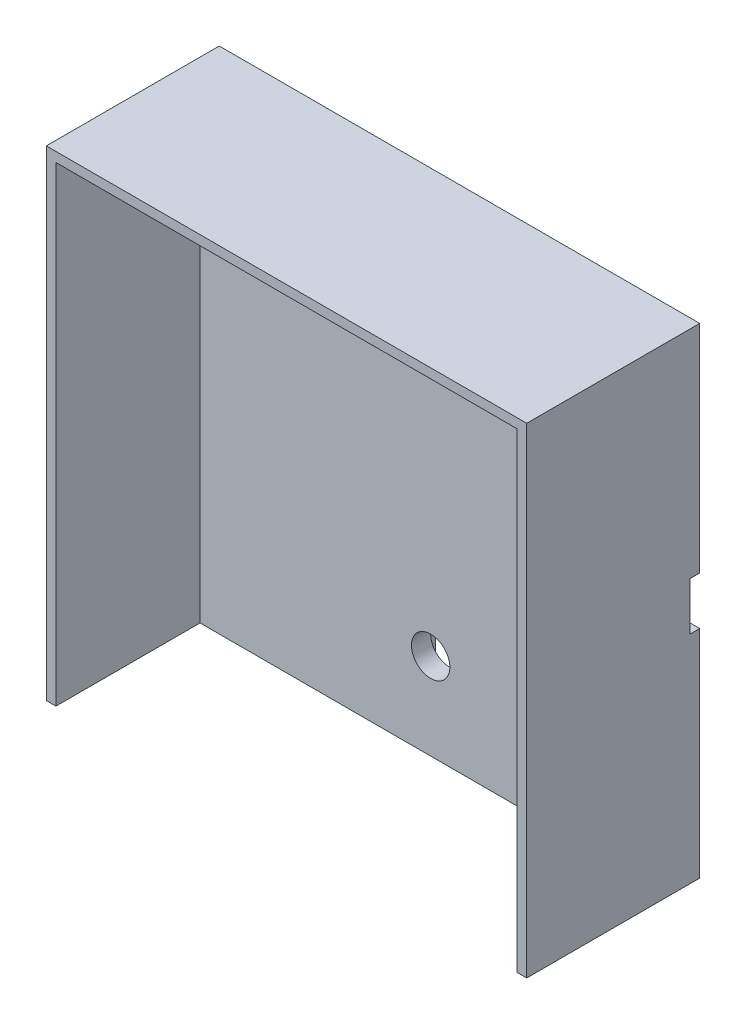
ISO-10303-21;
HEADER;
FILE_DESCRIPTION(('STEP AP214'),'2;1');
FILE_NAME('part.step','',(''),(''),'','','');
FILE_SCHEMA(('AUTOMOTIVE_DESIGN { 1 0 10303 214 1 1 1 1 }'));
ENDSEC;
DATA;
#1=APPLICATION_CONTEXT('core data for automotive mechanical design processes');
#2=APPLICATION_PROTOCOL_DEFINITION('international standard','automotive_design',2000,#1);
#3=PRODUCT_CONTEXT('',#1,'mechanical');
#4=PRODUCT('Part','Part','',(#3));
#5=PRODUCT_RELATED_PRODUCT_CATEGORY('part','',(#4));
#6=PRODUCT_DEFINITION_FORMATION('','',#4);
#7=PRODUCT_DEFINITION_CONTEXT('part definition',#1,'design');
#8=PRODUCT_DEFINITION('design','',#6,#7);
#9=PRODUCT_DEFINITION_SHAPE('','',#8);
#10=(LENGTH_UNIT() NAMED_UNIT(*) SI_UNIT(.MILLI.,.METRE.));
#11=(NAMED_UNIT(*) PLANE_ANGLE_UNIT() SI_UNIT($,.RADIAN.));
#12=(NAMED_UNIT(*) SI_UNIT($,.STERADIAN.) SOLID_ANGLE_UNIT());
#13=UNCERTAINTY_MEASURE_WITH_UNIT(LENGTH_MEASURE(1.E-05),#10,'distance_accuracy_value','');
#14=(GEOMETRIC_REPRESENTATION_CONTEXT(3) GLOBAL_UNCERTAINTY_ASSIGNED_CONTEXT((#13)) GLOBAL_UNIT_ASSIGNED_CONTEXT((#10,
#11,#12)) REPRESENTATION_CONTEXT('',''));
#15=CARTESIAN_POINT('',(0.,0.,0.));
#16=DIRECTION('',(0.,0.,1.));
#17=DIRECTION('',(1.,0.,0.));
#18=AXIS2_PLACEMENT_3D('',#15,#16,#17);
#19=CARTESIAN_POINT('',(0.,0.,3.));
#20=DIRECTION('',(0.,0.,1.));
#21=DIRECTION('',(1.,0.,0.));
#22=AXIS2_PLACEMENT_3D('',#19,#20,#21);
#23=PLANE('',#22);
#24=CARTESIAN_POINT('',(16.,0.,3.));
#25=DIRECTION('',(0.,0.,1.));
#26=DIRECTION('',(1.,0.,0.));
#27=AXIS2_PLACEMENT_3D('',#24,#25,#26);
#28=CIRCLE('',#27,2.);
#29=CARTESIAN_POINT('',(18.,0.,3.));
#30=VERTEX_POINT('',#29);
#31=EDGE_CURVE('E362',#30,#30,#28,.T.);
#32=ORIENTED_EDGE('',*,*,#31,.F.);
#33=EDGE_LOOP('',(#32));
#34=FACE_BOUND('',#33,.T.);
#35=CARTESIAN_POINT('',(0.,-16.,3.));
#36=DIRECTION('',(0.,0.,1.));
#37=DIRECTION('',(1.,0.,0.));
#38=AXIS2_PLACEMENT_3D('',#35,#36,#37);
#39=CIRCLE('',#38,2.);
#40=CARTESIAN_POINT('',(2.,-16.,3.));
#41=VERTEX_POINT('',#40);
#42=EDGE_CURVE('E415',#41,#41,#39,.T.);
#43=ORIENTED_EDGE('',*,*,#42,.F.);
#44=EDGE_LOOP('',(#43));
#45=FACE_BOUND('',#44,.T.);
#46=DIRECTION('',(1.,0.,0.));
#47=VECTOR('',#46,1.);
#48=CARTESIAN_POINT('',(0.,24.,3.));
#49=LINE('',#48,#47);
#50=CARTESIAN_POINT('',(-24.,24.,3.));
#51=VERTEX_POINT('',#50);
#52=CARTESIAN_POINT('',(24.,24.,3.));
#53=VERTEX_POINT('',#52);
#54=EDGE_CURVE('E197',#51,#53,#49,.T.);
#55=ORIENTED_EDGE('',*,*,#54,.F.);
#56=DIRECTION('',(0.,-1.,0.));
#57=VECTOR('',#56,1.);
#58=CARTESIAN_POINT('',(-24.,0.,3.));
#59=LINE('',#58,#57);
#60=CARTESIAN_POINT('',(-24.,-25.,3.));
#61=VERTEX_POINT('',#60);
#62=EDGE_CURVE('E194',#51,#61,#59,.T.);
#63=ORIENTED_EDGE('',*,*,#62,.T.);
#64=DIRECTION('',(-1.,0.,0.));
#65=VECTOR('',#64,1.);
#66=CARTESIAN_POINT('',(25.,-25.,3.));
#67=LINE('',#66,#65);
#68=CARTESIAN_POINT('',(24.,-25.,3.));
#69=VERTEX_POINT('',#68);
#70=EDGE_CURVE('E240',#69,#61,#67,.T.);
#71=ORIENTED_EDGE('',*,*,#70,.F.);
#72=DIRECTION('',(0.,-1.,0.));
#73=VECTOR('',#72,1.);
#74=CARTESIAN_POINT('',(24.,0.,3.));
#75=LINE('',#74,#73);
#76=EDGE_CURVE('E361',#53,#69,#75,.T.);
#77=ORIENTED_EDGE('',*,*,#76,.F.);
#78=EDGE_LOOP('',(#55,#63,#71,#77));
#79=FACE_BOUND('',#78,.T.);
#80=ADVANCED_FACE('F59',(#34,#45,#79),#23,.T.);
#81=CARTESIAN_POINT('',(25.,25.,3.));
#82=DIRECTION('',(1.,0.,0.));
#83=DIRECTION('',(0.,1.,0.));
#84=AXIS2_PLACEMENT_3D('',#81,#82,#83);
#85=PLANE('',#84);
#86=DIRECTION('',(0.,1.,0.));
#87=VECTOR('',#86,1.);
#88=CARTESIAN_POINT('',(25.,-2.5,1.));
#89=LINE('',#88,#87);
#90=CARTESIAN_POINT('',(25.,-2.5,1.));
#91=VERTEX_POINT('',#90);
#92=CARTESIAN_POINT('',(25.,2.5,1.));
#93=VERTEX_POINT('',#92);
#94=EDGE_CURVE('E215',#91,#93,#89,.T.);
#95=ORIENTED_EDGE('',*,*,#94,.T.);
#96=DIRECTION('',(0.,0.,-1.));
#97=VECTOR('',#96,1.);
#98=CARTESIAN_POINT('',(25.,2.5,1.));
#99=LINE('',#98,#97);
#100=CARTESIAN_POINT('',(25.,2.5,0.));
#101=VERTEX_POINT('',#100);
#102=EDGE_CURVE('E218',#93,#101,#99,.T.);
#103=ORIENTED_EDGE('',*,*,#102,.T.);
#104=DIRECTION('',(0.,-1.,0.));
#105=VECTOR('',#104,1.);
#106=CARTESIAN_POINT('',(25.,25.,0.));
#107=LINE('',#106,#105);
#108=CARTESIAN_POINT('',(25.,25.,0.));
#109=VERTEX_POINT('',#108);
#110=EDGE_CURVE('E244',#109,#101,#107,.T.);
#111=ORIENTED_EDGE('',*,*,#110,.F.);
#112=DIRECTION('',(0.,0.,-1.));
#113=VECTOR('',#112,1.);
#114=CARTESIAN_POINT('',(25.,25.,3.));
#115=LINE('',#114,#113);
#116=CARTESIAN_POINT('',(25.,25.,18.));
#117=VERTEX_POINT('',#116);
#118=EDGE_CURVE('E260',#117,#109,#115,.T.);
#119=ORIENTED_EDGE('',*,*,#118,.F.);
#120=DIRECTION('',(0.,1.,0.));
#121=VECTOR('',#120,1.);
#122=CARTESIAN_POINT('',(25.,0.,18.));
#123=LINE('',#122,#121);
#124=CARTESIAN_POINT('',(25.,-25.,18.));
#125=VERTEX_POINT('',#124);
#126=EDGE_CURVE('E346',#125,#117,#123,.T.);
#127=ORIENTED_EDGE('',*,*,#126,.F.);
#128=DIRECTION('',(0.,0.,-1.));
#129=VECTOR('',#128,1.);
#130=CARTESIAN_POINT('',(25.,-25.,3.));
#131=LINE('',#130,#129);
#132=CARTESIAN_POINT('',(25.,-25.,0.));
#133=VERTEX_POINT('',#132);
#134=EDGE_CURVE('E256',#125,#133,#131,.T.);
#135=ORIENTED_EDGE('',*,*,#134,.T.);
#136=CARTESIAN_POINT('',(25.,-2.5,0.));
#137=VERTEX_POINT('',#136);
#138=EDGE_CURVE('E253',#137,#133,#107,.T.);
#139=ORIENTED_EDGE('',*,*,#138,.F.);
#140=DIRECTION('',(0.,0.,-1.));
#141=VECTOR('',#140,1.);
#142=CARTESIAN_POINT('',(25.,-2.5,1.));
#143=LINE('',#142,#141);
#144=EDGE_CURVE('E229',#91,#137,#143,.T.);
#145=ORIENTED_EDGE('',*,*,#144,.F.);
#146=EDGE_LOOP('',(#95,#103,#111,#119,#127,#135,#139,#145));
#147=FACE_BOUND('',#146,.T.);
#148=ADVANCED_FACE('F304',(#147),#85,.T.);
#149=CARTESIAN_POINT('',(0.,0.,0.));
#150=DIRECTION('',(0.,0.,1.));
#151=DIRECTION('',(1.,0.,0.));
#152=AXIS2_PLACEMENT_3D('',#149,#150,#151);
#153=PLANE('',#152);
#154=DIRECTION('',(-1.,0.,0.));
#155=VECTOR('',#154,1.);
#156=CARTESIAN_POINT('',(25.,2.5,0.));
#157=LINE('',#156,#155);
#158=CARTESIAN_POINT('',(7.5,2.5,0.));
#159=VERTEX_POINT('',#158);
#160=EDGE_CURVE('E219',#101,#159,#157,.T.);
#161=ORIENTED_EDGE('',*,*,#160,.T.);
#162=CARTESIAN_POINT('',(7.5,-7.5,0.));
#163=DIRECTION('',(0.,0.,1.));
#164=DIRECTION('',(1.,0.,0.));
#165=AXIS2_PLACEMENT_3D('',#162,#163,#164);
#166=CIRCLE('',#165,10.);
#167=CARTESIAN_POINT('',(-2.5,-7.5,0.));
#168=VERTEX_POINT('',#167);
#169=EDGE_CURVE('E273',#159,#168,#166,.T.);
#170=ORIENTED_EDGE('',*,*,#169,.T.);
#171=DIRECTION('',(0.,1.,0.));
#172=VECTOR('',#171,1.);
#173=CARTESIAN_POINT('',(-2.5,-2.5,0.));
#174=LINE('',#173,#172);
#175=CARTESIAN_POINT('',(-2.5,-25.,0.));
#176=VERTEX_POINT('',#175);
#177=EDGE_CURVE('E222',#176,#168,#174,.T.);
#178=ORIENTED_EDGE('',*,*,#177,.F.);
#179=DIRECTION('',(-1.,0.,0.));
#180=VECTOR('',#179,1.);
#181=CARTESIAN_POINT('',(25.,-25.,0.));
#182=LINE('',#181,#180);
#183=CARTESIAN_POINT('',(-25.,-25.,0.));
#184=VERTEX_POINT('',#183);
#185=EDGE_CURVE('E231',#176,#184,#182,.T.);
#186=ORIENTED_EDGE('',*,*,#185,.T.);
#187=DIRECTION('',(0.,-1.,0.));
#188=VECTOR('',#187,1.);
#189=CARTESIAN_POINT('',(-25.,25.,0.));
#190=LINE('',#189,#188);
#191=CARTESIAN_POINT('',(-25.,25.,0.));
#192=VERTEX_POINT('',#191);
#193=EDGE_CURVE('E248',#192,#184,#190,.T.);
#194=ORIENTED_EDGE('',*,*,#193,.F.);
#195=DIRECTION('',(-1.,0.,0.));
#196=VECTOR('',#195,1.);
#197=CARTESIAN_POINT('',(25.,25.,0.));
#198=LINE('',#197,#196);
#199=EDGE_CURVE('E251',#109,#192,#198,.T.);
#200=ORIENTED_EDGE('',*,*,#199,.F.);
#201=ORIENTED_EDGE('',*,*,#110,.T.);
#202=EDGE_LOOP('',(#161,#170,#178,#186,#194,#200,#201));
#203=FACE_BOUND('',#202,.T.);
#204=ADVANCED_FACE('F310',(#203),#153,.F.);
#205=CARTESIAN_POINT('',(25.,-25.,3.));
#206=DIRECTION('',(0.,-1.,0.));
#207=DIRECTION('',(1.,0.,0.));
#208=AXIS2_PLACEMENT_3D('',#205,#206,#207);
#209=PLANE('',#208);
#210=DIRECTION('',(0.,0.,-1.));
#211=VECTOR('',#210,1.);
#212=CARTESIAN_POINT('',(-2.5,-25.,1.));
#213=LINE('',#212,#211);
#214=CARTESIAN_POINT('',(-2.5,-25.,1.));
#215=VERTEX_POINT('',#214);
#216=EDGE_CURVE('E235',#215,#176,#213,.T.);
#217=ORIENTED_EDGE('',*,*,#216,.F.);
#218=DIRECTION('',(-1.,0.,0.));
#219=VECTOR('',#218,1.);
#220=CARTESIAN_POINT('',(2.5,-25.,1.));
#221=LINE('',#220,#219);
#222=CARTESIAN_POINT('',(2.5,-25.,1.));
#223=VERTEX_POINT('',#222);
#224=EDGE_CURVE('E200',#223,#215,#221,.T.);
#225=ORIENTED_EDGE('',*,*,#224,.F.);
#226=DIRECTION('',(0.,0.,-1.));
#227=VECTOR('',#226,1.);
#228=CARTESIAN_POINT('',(2.5,-25.,1.));
#229=LINE('',#228,#227);
#230=CARTESIAN_POINT('',(2.5,-25.,0.));
#231=VERTEX_POINT('',#230);
#232=EDGE_CURVE('E223',#223,#231,#229,.T.);
#233=ORIENTED_EDGE('',*,*,#232,.T.);
#234=EDGE_CURVE('E245',#133,#231,#182,.T.);
#235=ORIENTED_EDGE('',*,*,#234,.F.);
#236=ORIENTED_EDGE('',*,*,#134,.F.);
#237=DIRECTION('',(1.,0.,0.));
#238=VECTOR('',#237,1.);
#239=CARTESIAN_POINT('',(0.,-25.,18.));
#240=LINE('',#239,#238);
#241=CARTESIAN_POINT('',(24.,-25.,18.));
#242=VERTEX_POINT('',#241);
#243=EDGE_CURVE('E184',#242,#125,#240,.T.);
#244=ORIENTED_EDGE('',*,*,#243,.F.);
#245=DIRECTION('',(0.,0.,-1.));
#246=VECTOR('',#245,1.);
#247=CARTESIAN_POINT('',(24.,-25.,18.));
#248=LINE('',#247,#246);
#249=EDGE_CURVE('E180',#242,#69,#248,.T.);
#250=ORIENTED_EDGE('',*,*,#249,.T.);
#251=ORIENTED_EDGE('',*,*,#70,.T.);
#252=DIRECTION('',(0.,0.,-1.));
#253=VECTOR('',#252,1.);
#254=CARTESIAN_POINT('',(-24.,-25.,18.));
#255=LINE('',#254,#253);
#256=CARTESIAN_POINT('',(-24.,-25.,18.));
#257=VERTEX_POINT('',#256);
#258=EDGE_CURVE('E202',#257,#61,#255,.T.);
#259=ORIENTED_EDGE('',*,*,#258,.F.);
#260=CARTESIAN_POINT('',(-25.,-25.,18.));
#261=VERTEX_POINT('',#260);
#262=EDGE_CURVE('E354',#261,#257,#240,.T.);
#263=ORIENTED_EDGE('',*,*,#262,.F.);
#264=DIRECTION('',(0.,0.,-1.));
#265=VECTOR('',#264,1.);
#266=CARTESIAN_POINT('',(-25.,-25.,3.));
#267=LINE('',#266,#265);
#268=EDGE_CURVE('E243',#261,#184,#267,.T.);
#269=ORIENTED_EDGE('',*,*,#268,.T.);
#270=ORIENTED_EDGE('',*,*,#185,.F.);
#271=EDGE_LOOP('',(#217,#225,#233,#235,#236,#244,#250,#251,#259,#263,#269,#270));
#272=FACE_BOUND('',#271,.T.);
#273=ADVANCED_FACE('F290',(#272),#209,.T.);
#274=CARTESIAN_POINT('',(25.,25.,3.));
#275=DIRECTION('',(0.,-1.,0.));
#276=DIRECTION('',(1.,0.,0.));
#277=AXIS2_PLACEMENT_3D('',#274,#275,#276);
#278=PLANE('',#277);
#279=ORIENTED_EDGE('',*,*,#199,.T.);
#280=DIRECTION('',(0.,0.,-1.));
#281=VECTOR('',#280,1.);
#282=CARTESIAN_POINT('',(-25.,25.,3.));
#283=LINE('',#282,#281);
#284=CARTESIAN_POINT('',(-25.,25.,18.));
#285=VERTEX_POINT('',#284);
#286=EDGE_CURVE('E262',#285,#192,#283,.T.);
#287=ORIENTED_EDGE('',*,*,#286,.F.);
#288=DIRECTION('',(-1.,0.,0.));
#289=VECTOR('',#288,1.);
#290=CARTESIAN_POINT('',(0.,25.,18.));
#291=LINE('',#290,#289);
#292=EDGE_CURVE('E349',#117,#285,#291,.T.);
#293=ORIENTED_EDGE('',*,*,#292,.F.);
#294=ORIENTED_EDGE('',*,*,#118,.T.);
#295=EDGE_LOOP('',(#279,#287,#293,#294));
#296=FACE_BOUND('',#295,.T.);
#297=ADVANCED_FACE('F322',(#296),#278,.F.);
#298=CARTESIAN_POINT('',(-25.,25.,3.));
#299=DIRECTION('',(1.,0.,0.));
#300=DIRECTION('',(0.,1.,0.));
#301=AXIS2_PLACEMENT_3D('',#298,#299,#300);
#302=PLANE('',#301);
#303=ORIENTED_EDGE('',*,*,#193,.T.);
#304=ORIENTED_EDGE('',*,*,#268,.F.);
#305=DIRECTION('',(0.,-1.,0.));
#306=VECTOR('',#305,1.);
#307=CARTESIAN_POINT('',(-25.,0.,18.));
#308=LINE('',#307,#306);
#309=EDGE_CURVE('E351',#285,#261,#308,.T.);
#310=ORIENTED_EDGE('',*,*,#309,.F.);
#311=ORIENTED_EDGE('',*,*,#286,.T.);
#312=EDGE_LOOP('',(#303,#304,#310,#311));
#313=FACE_BOUND('',#312,.T.);
#314=ADVANCED_FACE('F320',(#313),#302,.F.);
#315=DIRECTION('',(0.,-1.,0.));
#316=VECTOR('',#315,1.);
#317=CARTESIAN_POINT('',(2.5,-2.5,0.));
#318=LINE('',#317,#316);
#319=CARTESIAN_POINT('',(2.5,-7.5,0.));
#320=VERTEX_POINT('',#319);
#321=EDGE_CURVE('E198',#320,#231,#318,.T.);
#322=ORIENTED_EDGE('',*,*,#321,.F.);
#323=CARTESIAN_POINT('',(7.5,-7.5,0.));
#324=DIRECTION('',(0.,0.,1.));
#325=DIRECTION('',(1.,0.,0.));
#326=AXIS2_PLACEMENT_3D('',#323,#324,#325);
#327=CIRCLE('',#326,5.);
#328=CARTESIAN_POINT('',(7.5,-2.5,0.));
#329=VERTEX_POINT('',#328);
#330=EDGE_CURVE('E81',#320,#329,#327,.F.);
#331=ORIENTED_EDGE('',*,*,#330,.T.);
#332=DIRECTION('',(-1.,0.,0.));
#333=VECTOR('',#332,1.);
#334=CARTESIAN_POINT('',(25.,-2.5,0.));
#335=LINE('',#334,#333);
#336=EDGE_CURVE('E210',#137,#329,#335,.T.);
#337=ORIENTED_EDGE('',*,*,#336,.F.);
#338=ORIENTED_EDGE('',*,*,#138,.T.);
#339=ORIENTED_EDGE('',*,*,#234,.T.);
#340=EDGE_LOOP('',(#322,#331,#337,#338,#339));
#341=FACE_BOUND('',#340,.T.);
#342=ADVANCED_FACE('F285',(#341),#153,.F.);
#343=CARTESIAN_POINT('',(25.,2.5,1.));
#344=DIRECTION('',(0.,-1.,0.));
#345=DIRECTION('',(0.,0.,-1.));
#346=AXIS2_PLACEMENT_3D('',#343,#344,#345);
#347=PLANE('',#346);
#348=DIRECTION('',(-1.,0.,0.));
#349=VECTOR('',#348,1.);
#350=CARTESIAN_POINT('',(25.,2.5,1.));
#351=LINE('',#350,#349);
#352=CARTESIAN_POINT('',(7.5,2.5,1.));
#353=VERTEX_POINT('',#352);
#354=EDGE_CURVE('E206',#93,#353,#351,.T.);
#355=ORIENTED_EDGE('',*,*,#354,.T.);
#356=DIRECTION('',(0.,0.,-1.));
#357=VECTOR('',#356,1.);
#358=CARTESIAN_POINT('',(7.5,2.5,1.));
#359=LINE('',#358,#357);
#360=EDGE_CURVE('E259',#353,#159,#359,.T.);
#361=ORIENTED_EDGE('',*,*,#360,.T.);
#362=ORIENTED_EDGE('',*,*,#160,.F.);
#363=ORIENTED_EDGE('',*,*,#102,.F.);
#364=EDGE_LOOP('',(#355,#361,#362,#363));
#365=FACE_BOUND('',#364,.T.);
#366=ADVANCED_FACE('F319',(#365),#347,.T.);
#367=CARTESIAN_POINT('',(0.,0.,1.));
#368=DIRECTION('',(0.,0.,-1.));
#369=DIRECTION('',(-1.,0.,0.));
#370=AXIS2_PLACEMENT_3D('',#367,#368,#369);
#371=PLANE('',#370);
#372=CARTESIAN_POINT('',(16.,0.,1.));
#373=DIRECTION('',(0.,0.,-1.));
#374=DIRECTION('',(-1.,0.,0.));
#375=AXIS2_PLACEMENT_3D('',#372,#373,#374);
#376=CIRCLE('',#375,2.);
#377=CARTESIAN_POINT('',(14.,0.,1.));
#378=VERTEX_POINT('',#377);
#379=EDGE_CURVE('E414',#378,#378,#376,.T.);
#380=ORIENTED_EDGE('',*,*,#379,.F.);
#381=EDGE_LOOP('',(#380));
#382=FACE_BOUND('',#381,.T.);
#383=CARTESIAN_POINT('',(0.,-16.,1.));
#384=DIRECTION('',(0.,0.,-1.));
#385=DIRECTION('',(-1.,0.,0.));
#386=AXIS2_PLACEMENT_3D('',#383,#384,#385);
#387=CIRCLE('',#386,2.);
#388=CARTESIAN_POINT('',(-2.,-16.,1.));
#389=VERTEX_POINT('',#388);
#390=EDGE_CURVE('E416',#389,#389,#387,.T.);
#391=ORIENTED_EDGE('',*,*,#390,.F.);
#392=EDGE_LOOP('',(#391));
#393=FACE_BOUND('',#392,.T.);
#394=DIRECTION('',(0.,1.,0.));
#395=VECTOR('',#394,1.);
#396=CARTESIAN_POINT('',(-2.5,-2.5,1.));
#397=LINE('',#396,#395);
#398=CARTESIAN_POINT('',(-2.5,-7.5,1.));
#399=VERTEX_POINT('',#398);
#400=EDGE_CURVE('E209',#215,#399,#397,.T.);
#401=ORIENTED_EDGE('',*,*,#400,.T.);
#402=CARTESIAN_POINT('',(7.5,-7.5,1.));
#403=DIRECTION('',(0.,0.,-1.));
#404=DIRECTION('',(-1.,0.,0.));
#405=AXIS2_PLACEMENT_3D('',#402,#403,#404);
#406=CIRCLE('',#405,10.);
#407=EDGE_CURVE('E271',#399,#353,#406,.T.);
#408=ORIENTED_EDGE('',*,*,#407,.T.);
#409=ORIENTED_EDGE('',*,*,#354,.F.);
#410=ORIENTED_EDGE('',*,*,#94,.F.);
#411=DIRECTION('',(-1.,0.,0.));
#412=VECTOR('',#411,1.);
#413=CARTESIAN_POINT('',(25.,-2.5,1.));
#414=LINE('',#413,#412);
#415=CARTESIAN_POINT('',(7.5,-2.5,1.));
#416=VERTEX_POINT('',#415);
#417=EDGE_CURVE('E213',#91,#416,#414,.T.);
#418=ORIENTED_EDGE('',*,*,#417,.T.);
#419=CARTESIAN_POINT('',(7.5,-7.5,1.));
#420=DIRECTION('',(0.,0.,-1.));
#421=DIRECTION('',(-1.,0.,0.));
#422=AXIS2_PLACEMENT_3D('',#419,#420,#421);
#423=CIRCLE('',#422,5.);
#424=CARTESIAN_POINT('',(2.5,-7.5,1.));
#425=VERTEX_POINT('',#424);
#426=EDGE_CURVE('E12',#416,#425,#423,.F.);
#427=ORIENTED_EDGE('',*,*,#426,.T.);
#428=DIRECTION('',(0.,-1.,0.));
#429=VECTOR('',#428,1.);
#430=CARTESIAN_POINT('',(2.5,-2.5,1.));
#431=LINE('',#430,#429);
#432=EDGE_CURVE('E234',#425,#223,#431,.T.);
#433=ORIENTED_EDGE('',*,*,#432,.T.);
#434=ORIENTED_EDGE('',*,*,#224,.T.);
#435=EDGE_LOOP('',(#401,#408,#409,#410,#418,#427,#433,#434));
#436=FACE_BOUND('',#435,.T.);
#437=ADVANCED_FACE('F294',(#382,#393,#436),#371,.T.);
#438=CARTESIAN_POINT('',(25.,-2.5,1.));
#439=DIRECTION('',(0.,-1.,0.));
#440=DIRECTION('',(0.,0.,-1.));
#441=AXIS2_PLACEMENT_3D('',#438,#439,#440);
#442=PLANE('',#441);
#443=ORIENTED_EDGE('',*,*,#336,.T.);
#444=DIRECTION('',(0.,0.,-1.));
#445=VECTOR('',#444,1.);
#446=CARTESIAN_POINT('',(7.5,-2.5,1.));
#447=LINE('',#446,#445);
#448=EDGE_CURVE('E67',#329,#416,#447,.F.);
#449=ORIENTED_EDGE('',*,*,#448,.T.);
#450=ORIENTED_EDGE('',*,*,#417,.F.);
#451=ORIENTED_EDGE('',*,*,#144,.T.);
#452=EDGE_LOOP('',(#443,#449,#450,#451));
#453=FACE_BOUND('',#452,.T.);
#454=ADVANCED_FACE('F343',(#453),#442,.F.);
#455=CARTESIAN_POINT('',(-2.5,-2.5,1.));
#456=DIRECTION('',(-1.,0.,0.));
#457=DIRECTION('',(0.,0.,1.));
#458=AXIS2_PLACEMENT_3D('',#455,#456,#457);
#459=PLANE('',#458);
#460=ORIENTED_EDGE('',*,*,#177,.T.);
#461=DIRECTION('',(0.,0.,-1.));
#462=VECTOR('',#461,1.);
#463=CARTESIAN_POINT('',(-2.5,-7.5,1.));
#464=LINE('',#463,#462);
#465=EDGE_CURVE('E269',#168,#399,#464,.F.);
#466=ORIENTED_EDGE('',*,*,#465,.T.);
#467=ORIENTED_EDGE('',*,*,#400,.F.);
#468=ORIENTED_EDGE('',*,*,#216,.T.);
#469=EDGE_LOOP('',(#460,#466,#467,#468));
#470=FACE_BOUND('',#469,.T.);
#471=ADVANCED_FACE('F376',(#470),#459,.F.);
#472=CARTESIAN_POINT('',(2.5,-2.5,1.));
#473=DIRECTION('',(1.,0.,0.));
#474=DIRECTION('',(0.,1.,0.));
#475=AXIS2_PLACEMENT_3D('',#472,#473,#474);
#476=PLANE('',#475);
#477=ORIENTED_EDGE('',*,*,#432,.F.);
#478=DIRECTION('',(0.,0.,-1.));
#479=VECTOR('',#478,1.);
#480=CARTESIAN_POINT('',(2.5,-7.5,1.));
#481=LINE('',#480,#479);
#482=EDGE_CURVE('E275',#425,#320,#481,.T.);
#483=ORIENTED_EDGE('',*,*,#482,.T.);
#484=ORIENTED_EDGE('',*,*,#321,.T.);
#485=ORIENTED_EDGE('',*,*,#232,.F.);
#486=EDGE_LOOP('',(#477,#483,#484,#485));
#487=FACE_BOUND('',#486,.T.);
#488=ADVANCED_FACE('F281',(#487),#476,.F.);
#489=CARTESIAN_POINT('',(0.,24.,18.));
#490=DIRECTION('',(0.,1.,0.));
#491=DIRECTION('',(0.,0.,1.));
#492=AXIS2_PLACEMENT_3D('',#489,#490,#491);
#493=PLANE('',#492);
#494=ORIENTED_EDGE('',*,*,#54,.T.);
#495=DIRECTION('',(0.,0.,-1.));
#496=VECTOR('',#495,1.);
#497=CARTESIAN_POINT('',(24.,24.,18.));
#498=LINE('',#497,#496);
#499=CARTESIAN_POINT('',(24.,24.,18.));
#500=VERTEX_POINT('',#499);
#501=EDGE_CURVE('E177',#500,#53,#498,.T.);
#502=ORIENTED_EDGE('',*,*,#501,.F.);
#503=DIRECTION('',(1.,0.,0.));
#504=VECTOR('',#503,1.);
#505=CARTESIAN_POINT('',(0.,24.,18.));
#506=LINE('',#505,#504);
#507=CARTESIAN_POINT('',(-24.,24.,18.));
#508=VERTEX_POINT('',#507);
#509=EDGE_CURVE('E185',#508,#500,#506,.T.);
#510=ORIENTED_EDGE('',*,*,#509,.F.);
#511=DIRECTION('',(0.,0.,-1.));
#512=VECTOR('',#511,1.);
#513=CARTESIAN_POINT('',(-24.,24.,18.));
#514=LINE('',#513,#512);
#515=EDGE_CURVE('E359',#508,#51,#514,.T.);
#516=ORIENTED_EDGE('',*,*,#515,.T.);
#517=EDGE_LOOP('',(#494,#502,#510,#516));
#518=FACE_BOUND('',#517,.T.);
#519=ADVANCED_FACE('F196',(#518),#493,.F.);
#520=CARTESIAN_POINT('',(24.,0.,18.));
#521=DIRECTION('',(1.,0.,0.));
#522=DIRECTION('',(0.,0.,-1.));
#523=AXIS2_PLACEMENT_3D('',#520,#521,#522);
#524=PLANE('',#523);
#525=ORIENTED_EDGE('',*,*,#76,.T.);
#526=ORIENTED_EDGE('',*,*,#249,.F.);
#527=DIRECTION('',(0.,-1.,0.));
#528=VECTOR('',#527,1.);
#529=CARTESIAN_POINT('',(24.,0.,18.));
#530=LINE('',#529,#528);
#531=EDGE_CURVE('E172',#500,#242,#530,.T.);
#532=ORIENTED_EDGE('',*,*,#531,.F.);
#533=ORIENTED_EDGE('',*,*,#501,.T.);
#534=EDGE_LOOP('',(#525,#526,#532,#533));
#535=FACE_BOUND('',#534,.T.);
#536=ADVANCED_FACE('F175',(#535),#524,.F.);
#537=CARTESIAN_POINT('',(-24.,0.,18.));
#538=DIRECTION('',(1.,0.,0.));
#539=DIRECTION('',(0.,1.,0.));
#540=AXIS2_PLACEMENT_3D('',#537,#538,#539);
#541=PLANE('',#540);
#542=ORIENTED_EDGE('',*,*,#62,.F.);
#543=ORIENTED_EDGE('',*,*,#515,.F.);
#544=DIRECTION('',(0.,-1.,0.));
#545=VECTOR('',#544,1.);
#546=CARTESIAN_POINT('',(-24.,0.,18.));
#547=LINE('',#546,#545);
#548=EDGE_CURVE('E191',#508,#257,#547,.T.);
#549=ORIENTED_EDGE('',*,*,#548,.T.);
#550=ORIENTED_EDGE('',*,*,#258,.T.);
#551=EDGE_LOOP('',(#542,#543,#549,#550));
#552=FACE_BOUND('',#551,.T.);
#553=ADVANCED_FACE('F369',(#552),#541,.T.);
#554=CARTESIAN_POINT('',(0.,0.,18.));
#555=DIRECTION('',(0.,0.,1.));
#556=DIRECTION('',(1.,0.,0.));
#557=AXIS2_PLACEMENT_3D('',#554,#555,#556);
#558=PLANE('',#557);
#559=ORIENTED_EDGE('',*,*,#509,.T.);
#560=ORIENTED_EDGE('',*,*,#531,.T.);
#561=ORIENTED_EDGE('',*,*,#243,.T.);
#562=ORIENTED_EDGE('',*,*,#126,.T.);
#563=ORIENTED_EDGE('',*,*,#292,.T.);
#564=ORIENTED_EDGE('',*,*,#309,.T.);
#565=ORIENTED_EDGE('',*,*,#262,.T.);
#566=ORIENTED_EDGE('',*,*,#548,.F.);
#567=EDGE_LOOP('',(#559,#560,#561,#562,#563,#564,#565,#566));
#568=FACE_BOUND('',#567,.T.);
#569=ADVANCED_FACE('F189',(#568),#558,.T.);
#570=CARTESIAN_POINT('',(0.,-16.,5.));
#571=DIRECTION('',(0.,0.,-1.));
#572=DIRECTION('',(-1.,0.,0.));
#573=AXIS2_PLACEMENT_3D('',#570,#571,#572);
#574=CYLINDRICAL_SURFACE('',#573,2.);
#575=ORIENTED_EDGE('',*,*,#42,.T.);
#576=EDGE_LOOP('',(#575));
#577=FACE_BOUND('',#576,.T.);
#578=ORIENTED_EDGE('',*,*,#390,.T.);
#579=EDGE_LOOP('',(#578));
#580=FACE_BOUND('',#579,.T.);
#581=ADVANCED_FACE('F403',(#577,#580),#574,.F.);
#582=CARTESIAN_POINT('',(16.,0.,5.));
#583=DIRECTION('',(0.,0.,-1.));
#584=DIRECTION('',(-1.,0.,0.));
#585=AXIS2_PLACEMENT_3D('',#582,#583,#584);
#586=CYLINDRICAL_SURFACE('',#585,2.);
#587=ORIENTED_EDGE('',*,*,#31,.T.);
#588=EDGE_LOOP('',(#587));
#589=FACE_BOUND('',#588,.T.);
#590=ORIENTED_EDGE('',*,*,#379,.T.);
#591=EDGE_LOOP('',(#590));
#592=FACE_BOUND('',#591,.T.);
#593=ADVANCED_FACE('F301',(#589,#592),#586,.F.);
#594=CARTESIAN_POINT('',(7.5,-7.5,1.));
#595=DIRECTION('',(0.,0.,-1.));
#596=DIRECTION('',(-1.,0.,0.));
#597=AXIS2_PLACEMENT_3D('',#594,#595,#596);
#598=CYLINDRICAL_SURFACE('',#597,10.);
#599=ORIENTED_EDGE('',*,*,#407,.F.);
#600=ORIENTED_EDGE('',*,*,#465,.F.);
#601=ORIENTED_EDGE('',*,*,#169,.F.);
#602=ORIENTED_EDGE('',*,*,#360,.F.);
#603=EDGE_LOOP('',(#599,#600,#601,#602));
#604=FACE_BOUND('',#603,.T.);
#605=ADVANCED_FACE('F297',(#604),#598,.F.);
#606=CARTESIAN_POINT('',(7.5,-7.5,1.));
#607=DIRECTION('',(0.,0.,-1.));
#608=DIRECTION('',(-1.,0.,0.));
#609=AXIS2_PLACEMENT_3D('',#606,#607,#608);
#610=CYLINDRICAL_SURFACE('',#609,5.);
#611=ORIENTED_EDGE('',*,*,#426,.F.);
#612=ORIENTED_EDGE('',*,*,#448,.F.);
#613=ORIENTED_EDGE('',*,*,#330,.F.);
#614=ORIENTED_EDGE('',*,*,#482,.F.);
#615=EDGE_LOOP('',(#611,#612,#613,#614));
#616=FACE_BOUND('',#615,.T.);
#617=ADVANCED_FACE('F61',(#616),#610,.T.);
#618=CLOSED_SHELL('',(#80,#148,#204,#273,#297,#314,#342,#366,#437,#454,#471,#488,#519,#536,#553,
#569,#581,#593,#605,#617));
#619=MANIFOLD_SOLID_BREP('B2',#618);
#620=ADVANCED_BREP_SHAPE_REPRESENTATION('',(#18,#619),#14);
#621=SHAPE_DEFINITION_REPRESENTATION(#9,#620);
ENDSEC;
END-ISO-10303-21;
